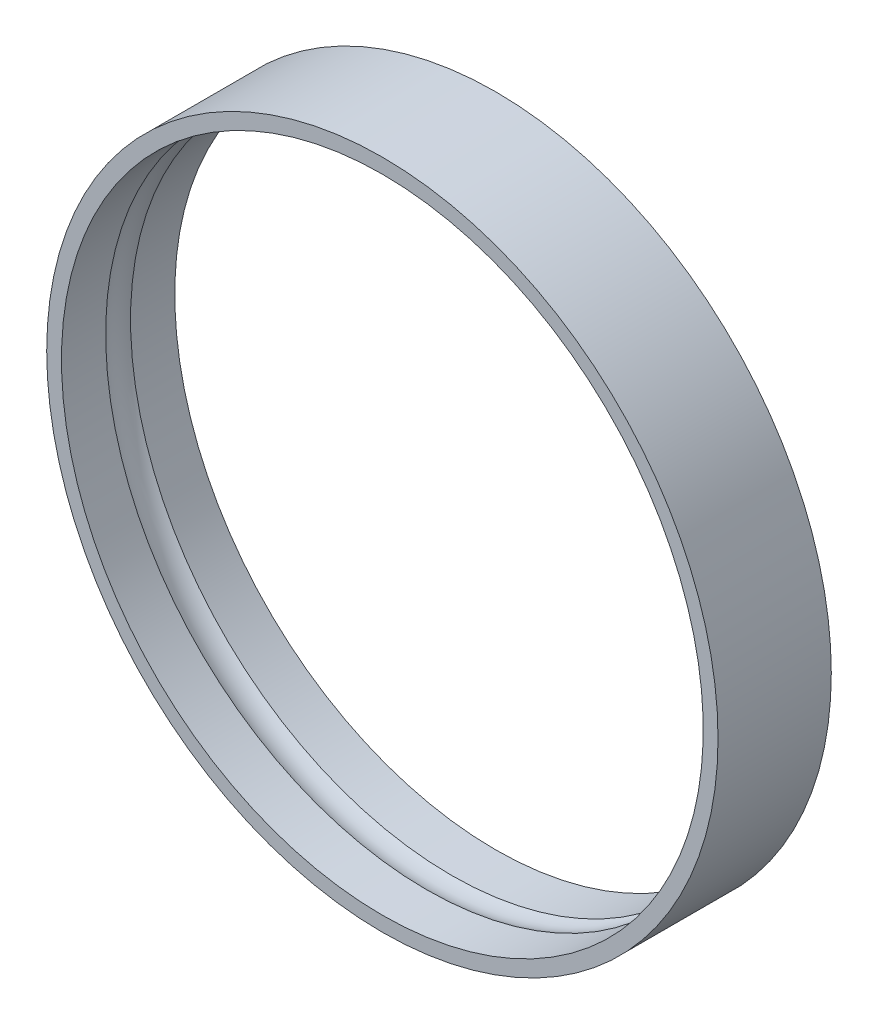
ISO-10303-21;
HEADER;
FILE_DESCRIPTION(('STEP AP214'),'2;1');
FILE_NAME('part.step','',(''),(''),'','','');
FILE_SCHEMA(('AUTOMOTIVE_DESIGN { 1 0 10303 214 1 1 1 1 }'));
ENDSEC;
DATA;
#1=APPLICATION_CONTEXT('core data for automotive mechanical design processes');
#2=APPLICATION_PROTOCOL_DEFINITION('international standard','automotive_design',2000,#1);
#3=PRODUCT_CONTEXT('',#1,'mechanical');
#4=PRODUCT('Part','Part','',(#3));
#5=PRODUCT_RELATED_PRODUCT_CATEGORY('part','',(#4));
#6=PRODUCT_DEFINITION_FORMATION('','',#4);
#7=PRODUCT_DEFINITION_CONTEXT('part definition',#1,'design');
#8=PRODUCT_DEFINITION('design','',#6,#7);
#9=PRODUCT_DEFINITION_SHAPE('','',#8);
#10=(LENGTH_UNIT() NAMED_UNIT(*) SI_UNIT(.MILLI.,.METRE.));
#11=(NAMED_UNIT(*) PLANE_ANGLE_UNIT() SI_UNIT($,.RADIAN.));
#12=(NAMED_UNIT(*) SI_UNIT($,.STERADIAN.) SOLID_ANGLE_UNIT());
#13=UNCERTAINTY_MEASURE_WITH_UNIT(LENGTH_MEASURE(1.E-05),#10,'distance_accuracy_value','');
#14=(GEOMETRIC_REPRESENTATION_CONTEXT(3) GLOBAL_UNCERTAINTY_ASSIGNED_CONTEXT((#13)) GLOBAL_UNIT_ASSIGNED_CONTEXT((#10,
#11,#12)) REPRESENTATION_CONTEXT('',''));
#15=CARTESIAN_POINT('',(0.,0.,0.));
#16=DIRECTION('',(0.,0.,1.));
#17=DIRECTION('',(1.,0.,0.));
#18=AXIS2_PLACEMENT_3D('',#15,#16,#17);
#19=CARTESIAN_POINT('',(0.,0.,-0.65));
#20=DIRECTION('',(0.,0.,1.));
#21=DIRECTION('',(0.,1.,0.));
#22=AXIS2_PLACEMENT_3D('',#19,#20,#21);
#23=CYLINDRICAL_SURFACE('',#22,13.031);
#24=CARTESIAN_POINT('',(0.,0.,1.65));
#25=DIRECTION('',(0.,0.,1.));
#26=DIRECTION('',(0.,-1.,0.));
#27=AXIS2_PLACEMENT_3D('',#24,#25,#26);
#28=CIRCLE('',#27,13.031);
#29=CARTESIAN_POINT('',(0.,-13.031,1.65));
#30=VERTEX_POINT('',#29);
#31=EDGE_CURVE('E11',#30,#30,#28,.T.);
#32=ORIENTED_EDGE('',*,*,#31,.T.);
#33=EDGE_LOOP('',(#32));
#34=FACE_BOUND('',#33,.T.);
#35=CARTESIAN_POINT('',(0.,0.,-0.144617966286875));
#36=DIRECTION('',(0.,0.,1.));
#37=DIRECTION('',(0.,-1.,0.));
#38=AXIS2_PLACEMENT_3D('',#35,#36,#37);
#39=CIRCLE('',#38,13.031);
#40=CARTESIAN_POINT('',(0.,-13.031,-0.144617966286875));
#41=VERTEX_POINT('',#40);
#42=EDGE_CURVE('E52',#41,#41,#39,.T.);
#43=ORIENTED_EDGE('',*,*,#42,.F.);
#44=EDGE_LOOP('',(#43));
#45=FACE_BOUND('',#44,.T.);
#46=ADVANCED_FACE('F17',(#34,#45),#23,.F.);
#47=CARTESIAN_POINT('',(13.031,0.,1.65));
#48=DIRECTION('',(0.,0.,1.));
#49=DIRECTION('',(0.,1.,0.));
#50=AXIS2_PLACEMENT_3D('',#47,#48,#49);
#51=PLANE('',#50);
#52=CARTESIAN_POINT('',(0.,0.,1.65));
#53=DIRECTION('',(0.,0.,1.));
#54=DIRECTION('',(0.,-1.,0.));
#55=AXIS2_PLACEMENT_3D('',#52,#53,#54);
#56=CIRCLE('',#55,13.631);
#57=CARTESIAN_POINT('',(0.,-13.631,1.65));
#58=VERTEX_POINT('',#57);
#59=EDGE_CURVE('E28',#58,#58,#56,.T.);
#60=ORIENTED_EDGE('',*,*,#59,.T.);
#61=EDGE_LOOP('',(#60));
#62=FACE_BOUND('',#61,.T.);
#63=ORIENTED_EDGE('',*,*,#31,.F.);
#64=EDGE_LOOP('',(#63));
#65=FACE_BOUND('',#64,.T.);
#66=ADVANCED_FACE('F84',(#62,#65),#51,.T.);
#67=CARTESIAN_POINT('',(0.,0.,-0.65));
#68=DIRECTION('',(0.,0.,1.));
#69=DIRECTION('',(0.,1.,0.));
#70=AXIS2_PLACEMENT_3D('',#67,#68,#69);
#71=CYLINDRICAL_SURFACE('',#70,13.631);
#72=CARTESIAN_POINT('',(0.,0.,-2.95));
#73=DIRECTION('',(0.,0.,1.));
#74=DIRECTION('',(0.,-1.,0.));
#75=AXIS2_PLACEMENT_3D('',#72,#73,#74);
#76=CIRCLE('',#75,13.631);
#77=CARTESIAN_POINT('',(0.,-13.631,-2.95));
#78=VERTEX_POINT('',#77);
#79=EDGE_CURVE('E57',#78,#78,#76,.T.);
#80=ORIENTED_EDGE('',*,*,#79,.T.);
#81=EDGE_LOOP('',(#80));
#82=FACE_BOUND('',#81,.T.);
#83=ORIENTED_EDGE('',*,*,#59,.F.);
#84=EDGE_LOOP('',(#83));
#85=FACE_BOUND('',#84,.T.);
#86=ADVANCED_FACE('F71',(#82,#85),#71,.T.);
#87=CARTESIAN_POINT('',(13.631,0.,-2.95));
#88=DIRECTION('',(0.,0.,-1.));
#89=DIRECTION('',(0.,-1.,0.));
#90=AXIS2_PLACEMENT_3D('',#87,#88,#89);
#91=PLANE('',#90);
#92=CARTESIAN_POINT('',(0.,0.,-2.95));
#93=DIRECTION('',(0.,0.,1.));
#94=DIRECTION('',(0.,-1.,0.));
#95=AXIS2_PLACEMENT_3D('',#92,#93,#94);
#96=CIRCLE('',#95,13.031);
#97=CARTESIAN_POINT('',(0.,-13.031,-2.95));
#98=VERTEX_POINT('',#97);
#99=EDGE_CURVE('E46',#98,#98,#96,.T.);
#100=ORIENTED_EDGE('',*,*,#99,.T.);
#101=EDGE_LOOP('',(#100));
#102=FACE_BOUND('',#101,.T.);
#103=ORIENTED_EDGE('',*,*,#79,.F.);
#104=EDGE_LOOP('',(#103));
#105=FACE_BOUND('',#104,.T.);
#106=ADVANCED_FACE('F74',(#102,#105),#91,.T.);
#107=CARTESIAN_POINT('',(0.,0.,-0.65));
#108=DIRECTION('',(0.,0.,1.));
#109=DIRECTION('',(0.,1.,0.));
#110=AXIS2_PLACEMENT_3D('',#107,#108,#109);
#111=CYLINDRICAL_SURFACE('',#110,13.031);
#112=CARTESIAN_POINT('',(0.,0.,-1.15538203371312));
#113=DIRECTION('',(0.,0.,1.));
#114=DIRECTION('',(0.,-1.,0.));
#115=AXIS2_PLACEMENT_3D('',#112,#113,#114);
#116=CIRCLE('',#115,13.031);
#117=CARTESIAN_POINT('',(0.,-13.031,-1.15538203371312));
#118=VERTEX_POINT('',#117);
#119=EDGE_CURVE('E21',#118,#118,#116,.T.);
#120=ORIENTED_EDGE('',*,*,#119,.T.);
#121=EDGE_LOOP('',(#120));
#122=FACE_BOUND('',#121,.T.);
#123=ORIENTED_EDGE('',*,*,#99,.F.);
#124=EDGE_LOOP('',(#123));
#125=FACE_BOUND('',#124,.T.);
#126=ADVANCED_FACE('F76',(#122,#125),#111,.F.);
#127=CARTESIAN_POINT('',(0.,0.,-0.65));
#128=DIRECTION('',(0.,0.,1.));
#129=DIRECTION('',(0.,1.,0.));
#130=AXIS2_PLACEMENT_3D('',#127,#128,#129);
#131=TOROIDAL_SURFACE('',#130,11.998,1.15);
#132=ORIENTED_EDGE('',*,*,#42,.T.);
#133=EDGE_LOOP('',(#132));
#134=FACE_BOUND('',#133,.T.);
#135=ORIENTED_EDGE('',*,*,#119,.F.);
#136=EDGE_LOOP('',(#135));
#137=FACE_BOUND('',#136,.T.);
#138=ADVANCED_FACE('F19',(#134,#137),#131,.F.);
#139=CLOSED_SHELL('',(#46,#66,#86,#106,#126,#138));
#140=MANIFOLD_SOLID_BREP('B1',#139);
#141=ADVANCED_BREP_SHAPE_REPRESENTATION('',(#18,#140),#14);
#142=SHAPE_DEFINITION_REPRESENTATION(#9,#141);
ENDSEC;
END-ISO-10303-21;
